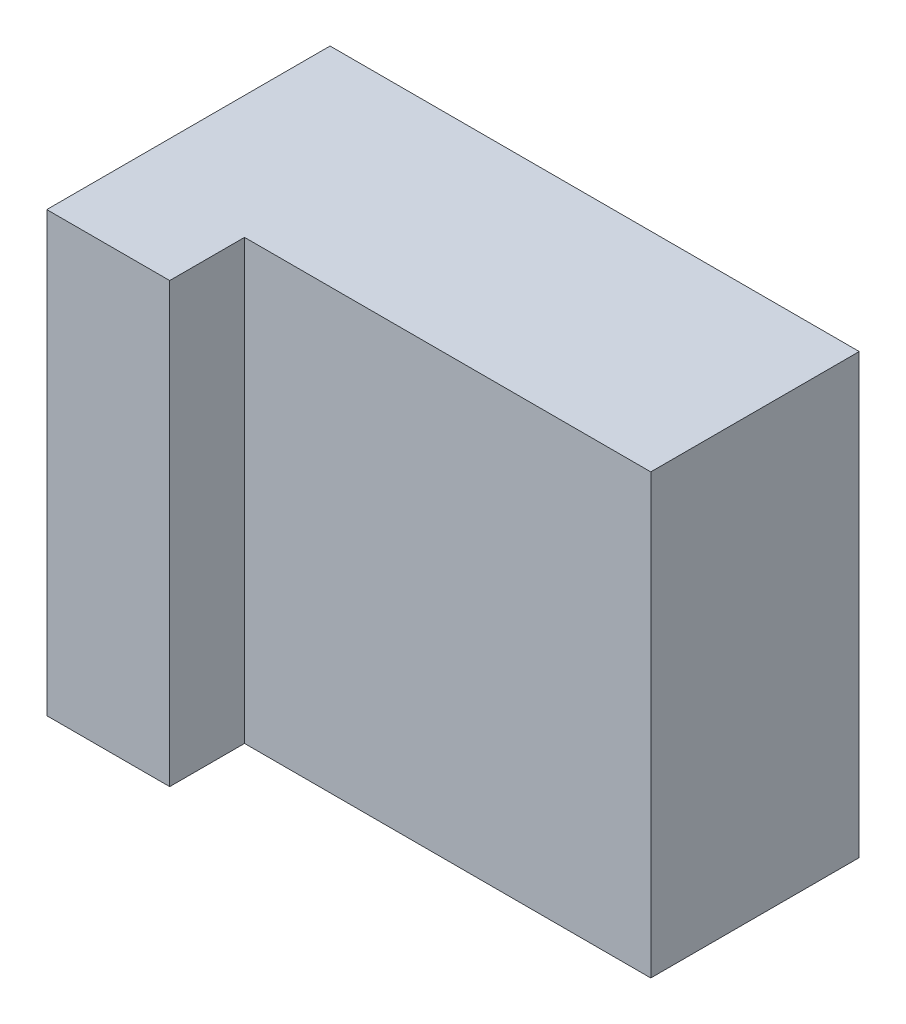
ISO-10303-21;
HEADER;
FILE_DESCRIPTION(('STEP AP214'),'2;1');
FILE_NAME('part.step','',(''),(''),'','','');
FILE_SCHEMA(('AUTOMOTIVE_DESIGN { 1 0 10303 214 1 1 1 1 }'));
ENDSEC;
DATA;
#1=APPLICATION_CONTEXT('core data for automotive mechanical design processes');
#2=APPLICATION_PROTOCOL_DEFINITION('international standard','automotive_design',2000,#1);
#3=PRODUCT_CONTEXT('',#1,'mechanical');
#4=PRODUCT('Part','Part','',(#3));
#5=PRODUCT_RELATED_PRODUCT_CATEGORY('part','',(#4));
#6=PRODUCT_DEFINITION_FORMATION('','',#4);
#7=PRODUCT_DEFINITION_CONTEXT('part definition',#1,'design');
#8=PRODUCT_DEFINITION('design','',#6,#7);
#9=PRODUCT_DEFINITION_SHAPE('','',#8);
#10=(LENGTH_UNIT() NAMED_UNIT(*) SI_UNIT(.MILLI.,.METRE.));
#11=(NAMED_UNIT(*) PLANE_ANGLE_UNIT() SI_UNIT($,.RADIAN.));
#12=(NAMED_UNIT(*) SI_UNIT($,.STERADIAN.) SOLID_ANGLE_UNIT());
#13=UNCERTAINTY_MEASURE_WITH_UNIT(LENGTH_MEASURE(1.E-05),#10,'distance_accuracy_value','');
#14=(GEOMETRIC_REPRESENTATION_CONTEXT(3) GLOBAL_UNCERTAINTY_ASSIGNED_CONTEXT((#13)) GLOBAL_UNIT_ASSIGNED_CONTEXT((#10,
#11,#12)) REPRESENTATION_CONTEXT('',''));
#15=CARTESIAN_POINT('',(0.,0.,0.));
#16=DIRECTION('',(0.,0.,1.));
#17=DIRECTION('',(1.,0.,0.));
#18=AXIS2_PLACEMENT_3D('',#15,#16,#17);
#19=CARTESIAN_POINT('',(23.,0.,35.));
#20=DIRECTION('',(0.,0.,1.));
#21=DIRECTION('',(1.,0.,0.));
#22=AXIS2_PLACEMENT_3D('',#19,#20,#21);
#23=PLANE('',#22);
#24=DIRECTION('',(1.,0.,0.));
#25=VECTOR('',#24,1.);
#26=CARTESIAN_POINT('',(-0.00199999999999853,1.,35.));
#27=LINE('',#26,#25);
#28=CARTESIAN_POINT('',(22.,1.,35.));
#29=VERTEX_POINT('',#28);
#30=CARTESIAN_POINT('',(98.,1.,35.));
#31=VERTEX_POINT('',#30);
#32=EDGE_CURVE('E166',#29,#31,#27,.T.);
#33=ORIENTED_EDGE('',*,*,#32,.F.);
#34=DIRECTION('',(0.,1.,0.));
#35=VECTOR('',#34,1.);
#36=CARTESIAN_POINT('',(22.,0.,35.));
#37=LINE('',#36,#35);
#38=CARTESIAN_POINT('',(22.,81.,35.));
#39=VERTEX_POINT('',#38);
#40=EDGE_CURVE('E140',#29,#39,#37,.T.);
#41=ORIENTED_EDGE('',*,*,#40,.T.);
#42=DIRECTION('',(-1.,0.,0.));
#43=VECTOR('',#42,1.);
#44=CARTESIAN_POINT('',(98.,81.,35.));
#45=LINE('',#44,#43);
#46=CARTESIAN_POINT('',(98.,81.,35.));
#47=VERTEX_POINT('',#46);
#48=EDGE_CURVE('E63',#47,#39,#45,.T.);
#49=ORIENTED_EDGE('',*,*,#48,.F.);
#50=DIRECTION('',(0.,1.,0.));
#51=VECTOR('',#50,1.);
#52=CARTESIAN_POINT('',(98.,1.,35.));
#53=LINE('',#52,#51);
#54=EDGE_CURVE('E174',#31,#47,#53,.T.);
#55=ORIENTED_EDGE('',*,*,#54,.F.);
#56=EDGE_LOOP('',(#33,#41,#49,#55));
#57=FACE_BOUND('',#56,.T.);
#58=ADVANCED_FACE('F39',(#57),#23,.F.);
#59=CARTESIAN_POINT('',(23.,0.,0.));
#60=DIRECTION('',(-1.,0.,0.));
#61=DIRECTION('',(0.,0.,1.));
#62=AXIS2_PLACEMENT_3D('',#59,#60,#61);
#63=PLANE('',#62);
#64=DIRECTION('',(0.,-1.,0.));
#65=VECTOR('',#64,1.);
#66=CARTESIAN_POINT('',(23.,0.,39.));
#67=LINE('',#66,#65);
#68=CARTESIAN_POINT('',(23.,82.,39.));
#69=VERTEX_POINT('',#68);
#70=CARTESIAN_POINT('',(23.,0.,39.));
#71=VERTEX_POINT('',#70);
#72=EDGE_CURVE('E137',#69,#71,#67,.T.);
#73=ORIENTED_EDGE('',*,*,#72,.F.);
#74=DIRECTION('',(0.,0.,1.));
#75=VECTOR('',#74,1.);
#76=CARTESIAN_POINT('',(23.,82.,53.));
#77=LINE('',#76,#75);
#78=CARTESIAN_POINT('',(23.,82.,53.));
#79=VERTEX_POINT('',#78);
#80=EDGE_CURVE('E194',#69,#79,#77,.T.);
#81=ORIENTED_EDGE('',*,*,#80,.T.);
#82=DIRECTION('',(0.,-1.,0.));
#83=VECTOR('',#82,1.);
#84=CARTESIAN_POINT('',(23.,0.,53.));
#85=LINE('',#84,#83);
#86=CARTESIAN_POINT('',(23.,0.,53.));
#87=VERTEX_POINT('',#86);
#88=EDGE_CURVE('E189',#79,#87,#85,.T.);
#89=ORIENTED_EDGE('',*,*,#88,.T.);
#90=DIRECTION('',(0.,0.,-1.));
#91=VECTOR('',#90,1.);
#92=CARTESIAN_POINT('',(23.,0.,53.));
#93=LINE('',#92,#91);
#94=EDGE_CURVE('E55',#87,#71,#93,.T.);
#95=ORIENTED_EDGE('',*,*,#94,.T.);
#96=EDGE_LOOP('',(#73,#81,#89,#95));
#97=FACE_BOUND('',#96,.T.);
#98=ADVANCED_FACE('F298',(#97),#63,.F.);
#99=CARTESIAN_POINT('',(0.,0.,52.));
#100=DIRECTION('',(1.,0.,0.));
#101=DIRECTION('',(0.,0.,-1.));
#102=AXIS2_PLACEMENT_3D('',#99,#100,#101);
#103=PLANE('',#102);
#104=DIRECTION('',(0.,-1.,0.));
#105=VECTOR('',#104,1.);
#106=CARTESIAN_POINT('',(0.,0.,0.));
#107=LINE('',#106,#105);
#108=CARTESIAN_POINT('',(0.,82.,0.));
#109=VERTEX_POINT('',#108);
#110=CARTESIAN_POINT('',(0.,0.,0.));
#111=VERTEX_POINT('',#110);
#112=EDGE_CURVE('E212',#109,#111,#107,.T.);
#113=ORIENTED_EDGE('',*,*,#112,.T.);
#114=DIRECTION('',(0.,0.,-1.));
#115=VECTOR('',#114,1.);
#116=CARTESIAN_POINT('',(0.,0.,52.));
#117=LINE('',#116,#115);
#118=CARTESIAN_POINT('',(0.,0.,53.));
#119=VERTEX_POINT('',#118);
#120=EDGE_CURVE('E11',#119,#111,#117,.T.);
#121=ORIENTED_EDGE('',*,*,#120,.F.);
#122=DIRECTION('',(0.,-1.,0.));
#123=VECTOR('',#122,1.);
#124=CARTESIAN_POINT('',(0.,82.,53.));
#125=LINE('',#124,#123);
#126=CARTESIAN_POINT('',(0.,82.,53.));
#127=VERTEX_POINT('',#126);
#128=EDGE_CURVE('E201',#127,#119,#125,.T.);
#129=ORIENTED_EDGE('',*,*,#128,.F.);
#130=DIRECTION('',(0.,0.,-1.));
#131=VECTOR('',#130,1.);
#132=CARTESIAN_POINT('',(0.,82.,52.));
#133=LINE('',#132,#131);
#134=EDGE_CURVE('E229',#127,#109,#133,.T.);
#135=ORIENTED_EDGE('',*,*,#134,.T.);
#136=EDGE_LOOP('',(#113,#121,#129,#135));
#137=FACE_BOUND('',#136,.T.);
#138=ADVANCED_FACE('F41',(#137),#103,.F.);
#139=CARTESIAN_POINT('',(0.,0.,52.));
#140=DIRECTION('',(0.,1.,0.));
#141=DIRECTION('',(0.,0.,1.));
#142=AXIS2_PLACEMENT_3D('',#139,#140,#141);
#143=PLANE('',#142);
#144=DIRECTION('',(1.,0.,0.));
#145=VECTOR('',#144,1.);
#146=CARTESIAN_POINT('',(0.,0.,0.));
#147=LINE('',#146,#145);
#148=CARTESIAN_POINT('',(99.,0.,0.));
#149=VERTEX_POINT('',#148);
#150=EDGE_CURVE('E145',#111,#149,#147,.T.);
#151=ORIENTED_EDGE('',*,*,#150,.T.);
#152=DIRECTION('',(0.,0.,-1.));
#153=VECTOR('',#152,1.);
#154=CARTESIAN_POINT('',(99.,0.,39.));
#155=LINE('',#154,#153);
#156=CARTESIAN_POINT('',(99.,0.,39.));
#157=VERTEX_POINT('',#156);
#158=EDGE_CURVE('E143',#157,#149,#155,.T.);
#159=ORIENTED_EDGE('',*,*,#158,.F.);
#160=DIRECTION('',(-1.,0.,0.));
#161=VECTOR('',#160,1.);
#162=CARTESIAN_POINT('',(98.,0.,39.));
#163=LINE('',#162,#161);
#164=EDGE_CURVE('E131',#157,#71,#163,.T.);
#165=ORIENTED_EDGE('',*,*,#164,.T.);
#166=ORIENTED_EDGE('',*,*,#94,.F.);
#167=DIRECTION('',(1.,0.,0.));
#168=VECTOR('',#167,1.);
#169=CARTESIAN_POINT('',(0.,0.,53.));
#170=LINE('',#169,#168);
#171=EDGE_CURVE('E205',#119,#87,#170,.T.);
#172=ORIENTED_EDGE('',*,*,#171,.F.);
#173=ORIENTED_EDGE('',*,*,#120,.T.);
#174=EDGE_LOOP('',(#151,#159,#165,#166,#172,#173));
#175=FACE_BOUND('',#174,.T.);
#176=ADVANCED_FACE('F144',(#175),#143,.F.);
#177=CARTESIAN_POINT('',(1.00000000000001,1.,52.));
#178=DIRECTION('',(0.,-1.,0.));
#179=DIRECTION('',(1.,0.,0.));
#180=AXIS2_PLACEMENT_3D('',#177,#178,#179);
#181=PLANE('',#180);
#182=DIRECTION('',(-1.,0.,0.));
#183=VECTOR('',#182,1.);
#184=CARTESIAN_POINT('',(1.00000000000001,1.,0.));
#185=LINE('',#184,#183);
#186=CARTESIAN_POINT('',(98.,1.,0.));
#187=VERTEX_POINT('',#186);
#188=CARTESIAN_POINT('',(1.00000000000001,1.,0.));
#189=VERTEX_POINT('',#188);
#190=EDGE_CURVE('E235',#187,#189,#185,.T.);
#191=ORIENTED_EDGE('',*,*,#190,.T.);
#192=DIRECTION('',(0.,0.,-1.));
#193=VECTOR('',#192,1.);
#194=CARTESIAN_POINT('',(1.00000000000001,1.,52.));
#195=LINE('',#194,#193);
#196=CARTESIAN_POINT('',(1.00000000000001,1.,52.));
#197=VERTEX_POINT('',#196);
#198=EDGE_CURVE('E257',#197,#189,#195,.T.);
#199=ORIENTED_EDGE('',*,*,#198,.F.);
#200=DIRECTION('',(-1.,0.,0.));
#201=VECTOR('',#200,1.);
#202=CARTESIAN_POINT('',(22.,1.,52.));
#203=LINE('',#202,#201);
#204=CARTESIAN_POINT('',(22.,1.,52.));
#205=VERTEX_POINT('',#204);
#206=EDGE_CURVE('E216',#205,#197,#203,.T.);
#207=ORIENTED_EDGE('',*,*,#206,.F.);
#208=DIRECTION('',(0.,0.,-1.));
#209=VECTOR('',#208,1.);
#210=CARTESIAN_POINT('',(22.,1.,52.));
#211=LINE('',#210,#209);
#212=EDGE_CURVE('E48',#205,#29,#211,.T.);
#213=ORIENTED_EDGE('',*,*,#212,.T.);
#214=ORIENTED_EDGE('',*,*,#32,.T.);
#215=DIRECTION('',(0.,0.,1.));
#216=VECTOR('',#215,1.);
#217=CARTESIAN_POINT('',(98.,1.,35.));
#218=LINE('',#217,#216);
#219=EDGE_CURVE('E170',#187,#31,#218,.T.);
#220=ORIENTED_EDGE('',*,*,#219,.F.);
#221=EDGE_LOOP('',(#191,#199,#207,#213,#214,#220));
#222=FACE_BOUND('',#221,.T.);
#223=ADVANCED_FACE('F265',(#222),#181,.F.);
#224=CARTESIAN_POINT('',(1.,81.,52.));
#225=DIRECTION('',(-1.,0.,0.));
#226=DIRECTION('',(0.,-1.,0.));
#227=AXIS2_PLACEMENT_3D('',#224,#225,#226);
#228=PLANE('',#227);
#229=DIRECTION('',(0.,1.,0.));
#230=VECTOR('',#229,1.);
#231=CARTESIAN_POINT('',(1.,81.,0.));
#232=LINE('',#231,#230);
#233=CARTESIAN_POINT('',(1.,81.,0.));
#234=VERTEX_POINT('',#233);
#235=EDGE_CURVE('E238',#189,#234,#232,.T.);
#236=ORIENTED_EDGE('',*,*,#235,.T.);
#237=DIRECTION('',(0.,0.,-1.));
#238=VECTOR('',#237,1.);
#239=CARTESIAN_POINT('',(1.,81.,52.));
#240=LINE('',#239,#238);
#241=CARTESIAN_POINT('',(1.,81.,52.));
#242=VERTEX_POINT('',#241);
#243=EDGE_CURVE('E253',#242,#234,#240,.T.);
#244=ORIENTED_EDGE('',*,*,#243,.F.);
#245=DIRECTION('',(0.,1.,0.));
#246=VECTOR('',#245,1.);
#247=CARTESIAN_POINT('',(1.,81.,52.));
#248=LINE('',#247,#246);
#249=EDGE_CURVE('E220',#197,#242,#248,.T.);
#250=ORIENTED_EDGE('',*,*,#249,.F.);
#251=ORIENTED_EDGE('',*,*,#198,.T.);
#252=EDGE_LOOP('',(#236,#244,#250,#251));
#253=FACE_BOUND('',#252,.T.);
#254=ADVANCED_FACE('F279',(#253),#228,.F.);
#255=CARTESIAN_POINT('',(22.,81.,52.));
#256=DIRECTION('',(0.,1.,0.));
#257=DIRECTION('',(0.,0.,1.));
#258=AXIS2_PLACEMENT_3D('',#255,#256,#257);
#259=PLANE('',#258);
#260=DIRECTION('',(1.,0.,0.));
#261=VECTOR('',#260,1.);
#262=CARTESIAN_POINT('',(22.,81.,0.));
#263=LINE('',#262,#261);
#264=CARTESIAN_POINT('',(98.,81.,0.));
#265=VERTEX_POINT('',#264);
#266=EDGE_CURVE('E242',#234,#265,#263,.T.);
#267=ORIENTED_EDGE('',*,*,#266,.T.);
#268=DIRECTION('',(0.,0.,-1.));
#269=VECTOR('',#268,1.);
#270=CARTESIAN_POINT('',(98.,81.,35.));
#271=LINE('',#270,#269);
#272=EDGE_CURVE('E178',#47,#265,#271,.T.);
#273=ORIENTED_EDGE('',*,*,#272,.F.);
#274=ORIENTED_EDGE('',*,*,#48,.T.);
#275=DIRECTION('',(0.,0.,-1.));
#276=VECTOR('',#275,1.);
#277=CARTESIAN_POINT('',(22.,81.,52.));
#278=LINE('',#277,#276);
#279=CARTESIAN_POINT('',(22.,81.,52.));
#280=VERTEX_POINT('',#279);
#281=EDGE_CURVE('E250',#280,#39,#278,.T.);
#282=ORIENTED_EDGE('',*,*,#281,.F.);
#283=DIRECTION('',(1.,0.,0.));
#284=VECTOR('',#283,1.);
#285=CARTESIAN_POINT('',(1.,81.,52.));
#286=LINE('',#285,#284);
#287=EDGE_CURVE('E225',#242,#280,#286,.T.);
#288=ORIENTED_EDGE('',*,*,#287,.F.);
#289=ORIENTED_EDGE('',*,*,#243,.T.);
#290=EDGE_LOOP('',(#267,#273,#274,#282,#288,#289));
#291=FACE_BOUND('',#290,.T.);
#292=ADVANCED_FACE('F282',(#291),#259,.F.);
#293=CARTESIAN_POINT('',(0.,82.,52.));
#294=DIRECTION('',(0.,-1.,0.));
#295=DIRECTION('',(0.,0.,-1.));
#296=AXIS2_PLACEMENT_3D('',#293,#294,#295);
#297=PLANE('',#296);
#298=DIRECTION('',(-1.,0.,0.));
#299=VECTOR('',#298,1.);
#300=CARTESIAN_POINT('',(98.,82.,39.));
#301=LINE('',#300,#299);
#302=CARTESIAN_POINT('',(99.,82.,39.));
#303=VERTEX_POINT('',#302);
#304=EDGE_CURVE('E182',#303,#69,#301,.T.);
#305=ORIENTED_EDGE('',*,*,#304,.F.);
#306=DIRECTION('',(0.,0.,1.));
#307=VECTOR('',#306,1.);
#308=CARTESIAN_POINT('',(99.,82.,39.));
#309=LINE('',#308,#307);
#310=CARTESIAN_POINT('',(99.,82.,0.));
#311=VERTEX_POINT('',#310);
#312=EDGE_CURVE('E155',#311,#303,#309,.T.);
#313=ORIENTED_EDGE('',*,*,#312,.F.);
#314=DIRECTION('',(-1.,0.,0.));
#315=VECTOR('',#314,1.);
#316=CARTESIAN_POINT('',(0.,82.,0.));
#317=LINE('',#316,#315);
#318=EDGE_CURVE('E221',#311,#109,#317,.T.);
#319=ORIENTED_EDGE('',*,*,#318,.T.);
#320=ORIENTED_EDGE('',*,*,#134,.F.);
#321=DIRECTION('',(-1.,0.,0.));
#322=VECTOR('',#321,1.);
#323=CARTESIAN_POINT('',(0.,82.,53.));
#324=LINE('',#323,#322);
#325=EDGE_CURVE('E208',#79,#127,#324,.T.);
#326=ORIENTED_EDGE('',*,*,#325,.F.);
#327=ORIENTED_EDGE('',*,*,#80,.F.);
#328=EDGE_LOOP('',(#305,#313,#319,#320,#326,#327));
#329=FACE_BOUND('',#328,.T.);
#330=ADVANCED_FACE('F295',(#329),#297,.F.);
#331=CARTESIAN_POINT('',(0.,0.,0.));
#332=DIRECTION('',(0.,0.,-1.));
#333=DIRECTION('',(-1.,0.,0.));
#334=AXIS2_PLACEMENT_3D('',#331,#332,#333);
#335=PLANE('',#334);
#336=ORIENTED_EDGE('',*,*,#190,.F.);
#337=DIRECTION('',(0.,1.,0.));
#338=VECTOR('',#337,1.);
#339=CARTESIAN_POINT('',(98.,0.,0.));
#340=LINE('',#339,#338);
#341=EDGE_CURVE('E157',#187,#265,#340,.T.);
#342=ORIENTED_EDGE('',*,*,#341,.T.);
#343=ORIENTED_EDGE('',*,*,#266,.F.);
#344=ORIENTED_EDGE('',*,*,#235,.F.);
#345=EDGE_LOOP('',(#336,#342,#343,#344));
#346=FACE_BOUND('',#345,.T.);
#347=ORIENTED_EDGE('',*,*,#112,.F.);
#348=ORIENTED_EDGE('',*,*,#318,.F.);
#349=DIRECTION('',(0.,1.,0.));
#350=VECTOR('',#349,1.);
#351=CARTESIAN_POINT('',(99.,0.,0.));
#352=LINE('',#351,#350);
#353=EDGE_CURVE('E150',#149,#311,#352,.T.);
#354=ORIENTED_EDGE('',*,*,#353,.F.);
#355=ORIENTED_EDGE('',*,*,#150,.F.);
#356=EDGE_LOOP('',(#347,#348,#354,#355));
#357=FACE_BOUND('',#356,.T.);
#358=ADVANCED_FACE('F280',(#346,#357),#335,.T.);
#359=CARTESIAN_POINT('',(0.,0.,52.));
#360=DIRECTION('',(0.,0.,1.));
#361=DIRECTION('',(1.,0.,0.));
#362=AXIS2_PLACEMENT_3D('',#359,#360,#361);
#363=PLANE('',#362);
#364=DIRECTION('',(0.,1.,0.));
#365=VECTOR('',#364,1.);
#366=CARTESIAN_POINT('',(22.,82.,52.));
#367=LINE('',#366,#365);
#368=EDGE_CURVE('E197',#205,#280,#367,.T.);
#369=ORIENTED_EDGE('',*,*,#368,.F.);
#370=ORIENTED_EDGE('',*,*,#206,.T.);
#371=ORIENTED_EDGE('',*,*,#249,.T.);
#372=ORIENTED_EDGE('',*,*,#287,.T.);
#373=EDGE_LOOP('',(#369,#370,#371,#372));
#374=FACE_BOUND('',#373,.T.);
#375=ADVANCED_FACE('F285',(#374),#363,.F.);
#376=CARTESIAN_POINT('',(0.,0.,53.));
#377=DIRECTION('',(0.,0.,1.));
#378=DIRECTION('',(1.,0.,0.));
#379=AXIS2_PLACEMENT_3D('',#376,#377,#378);
#380=PLANE('',#379);
#381=ORIENTED_EDGE('',*,*,#128,.T.);
#382=ORIENTED_EDGE('',*,*,#171,.T.);
#383=ORIENTED_EDGE('',*,*,#88,.F.);
#384=ORIENTED_EDGE('',*,*,#325,.T.);
#385=EDGE_LOOP('',(#381,#382,#383,#384));
#386=FACE_BOUND('',#385,.T.);
#387=ADVANCED_FACE('F287',(#386),#380,.T.);
#388=CARTESIAN_POINT('',(22.,0.,0.));
#389=DIRECTION('',(-1.,0.,0.));
#390=DIRECTION('',(0.,0.,1.));
#391=AXIS2_PLACEMENT_3D('',#388,#389,#390);
#392=PLANE('',#391);
#393=ORIENTED_EDGE('',*,*,#212,.F.);
#394=ORIENTED_EDGE('',*,*,#368,.T.);
#395=ORIENTED_EDGE('',*,*,#281,.T.);
#396=ORIENTED_EDGE('',*,*,#40,.F.);
#397=EDGE_LOOP('',(#393,#394,#395,#396));
#398=FACE_BOUND('',#397,.T.);
#399=ADVANCED_FACE('F270',(#398),#392,.T.);
#400=CARTESIAN_POINT('',(98.,0.,39.));
#401=DIRECTION('',(0.,0.,-1.));
#402=DIRECTION('',(-1.,0.,0.));
#403=AXIS2_PLACEMENT_3D('',#400,#401,#402);
#404=PLANE('',#403);
#405=ORIENTED_EDGE('',*,*,#72,.T.);
#406=ORIENTED_EDGE('',*,*,#164,.F.);
#407=DIRECTION('',(0.,-1.,0.));
#408=VECTOR('',#407,1.);
#409=CARTESIAN_POINT('',(99.,0.,39.));
#410=LINE('',#409,#408);
#411=EDGE_CURVE('E136',#303,#157,#410,.T.);
#412=ORIENTED_EDGE('',*,*,#411,.F.);
#413=ORIENTED_EDGE('',*,*,#304,.T.);
#414=EDGE_LOOP('',(#405,#406,#412,#413));
#415=FACE_BOUND('',#414,.T.);
#416=ADVANCED_FACE('F133',(#415),#404,.F.);
#417=CARTESIAN_POINT('',(99.,0.,0.));
#418=DIRECTION('',(-1.,0.,0.));
#419=DIRECTION('',(0.,0.,1.));
#420=AXIS2_PLACEMENT_3D('',#417,#418,#419);
#421=PLANE('',#420);
#422=ORIENTED_EDGE('',*,*,#411,.T.);
#423=ORIENTED_EDGE('',*,*,#158,.T.);
#424=ORIENTED_EDGE('',*,*,#353,.T.);
#425=ORIENTED_EDGE('',*,*,#312,.T.);
#426=EDGE_LOOP('',(#422,#423,#424,#425));
#427=FACE_BOUND('',#426,.T.);
#428=ADVANCED_FACE('F153',(#427),#421,.F.);
#429=CARTESIAN_POINT('',(98.,0.,0.));
#430=DIRECTION('',(-1.,0.,0.));
#431=DIRECTION('',(0.,0.,1.));
#432=AXIS2_PLACEMENT_3D('',#429,#430,#431);
#433=PLANE('',#432);
#434=ORIENTED_EDGE('',*,*,#341,.F.);
#435=ORIENTED_EDGE('',*,*,#219,.T.);
#436=ORIENTED_EDGE('',*,*,#54,.T.);
#437=ORIENTED_EDGE('',*,*,#272,.T.);
#438=EDGE_LOOP('',(#434,#435,#436,#437));
#439=FACE_BOUND('',#438,.T.);
#440=ADVANCED_FACE('F274',(#439),#433,.T.);
#441=CLOSED_SHELL('',(#58,#98,#138,#176,#223,#254,#292,#330,#358,#375,#387,#399,#416,#428,#440));
#442=MANIFOLD_SOLID_BREP('B2',#441);
#443=ADVANCED_BREP_SHAPE_REPRESENTATION('',(#18,#442),#14);
#444=SHAPE_DEFINITION_REPRESENTATION(#9,#443);
ENDSEC;
END-ISO-10303-21;
